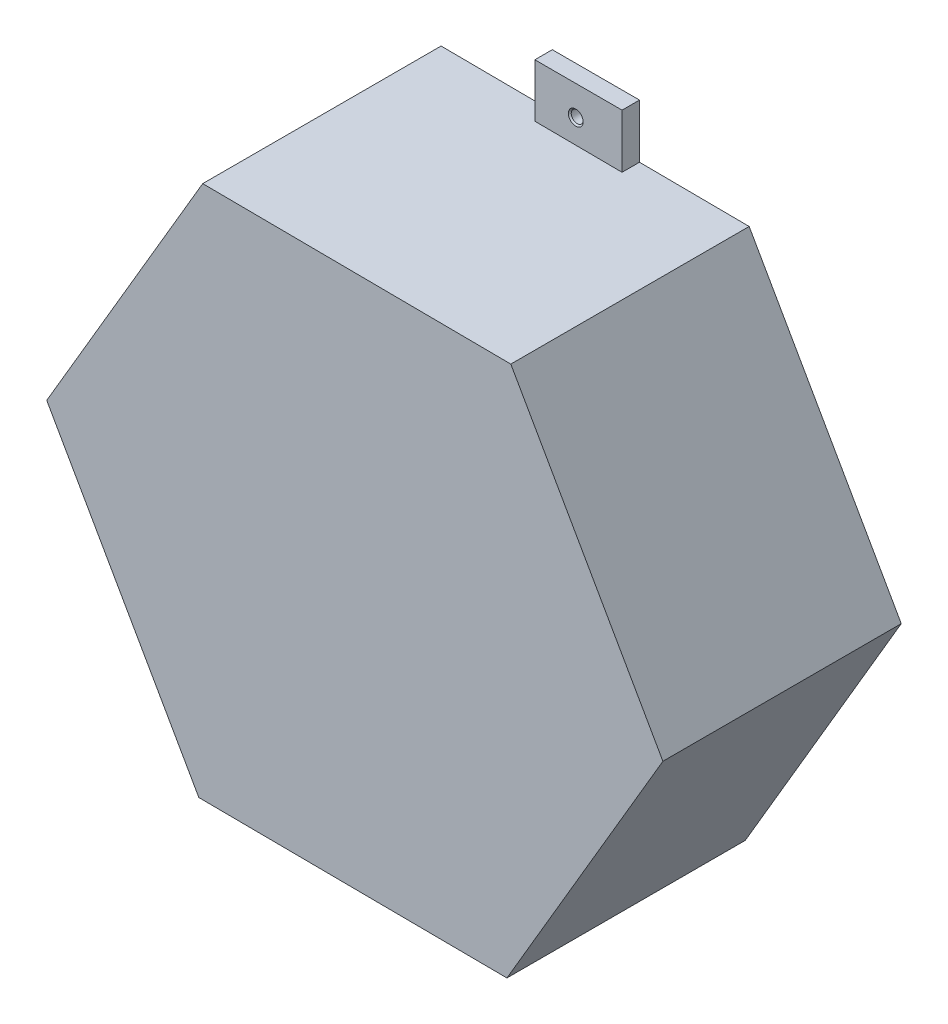
ISO-10303-21;
HEADER;
FILE_DESCRIPTION(('STEP AP214'),'2;1');
FILE_NAME('part.step','',(''),(''),'','','');
FILE_SCHEMA(('AUTOMOTIVE_DESIGN { 1 0 10303 214 1 1 1 1 }'));
ENDSEC;
DATA;
#1=APPLICATION_CONTEXT('core data for automotive mechanical design processes');
#2=APPLICATION_PROTOCOL_DEFINITION('international standard','automotive_design',2000,#1);
#3=PRODUCT_CONTEXT('',#1,'mechanical');
#4=PRODUCT('Part','Part','',(#3));
#5=PRODUCT_RELATED_PRODUCT_CATEGORY('part','',(#4));
#6=PRODUCT_DEFINITION_FORMATION('','',#4);
#7=PRODUCT_DEFINITION_CONTEXT('part definition',#1,'design');
#8=PRODUCT_DEFINITION('design','',#6,#7);
#9=PRODUCT_DEFINITION_SHAPE('','',#8);
#10=(LENGTH_UNIT() NAMED_UNIT(*) SI_UNIT(.MILLI.,.METRE.));
#11=(NAMED_UNIT(*) PLANE_ANGLE_UNIT() SI_UNIT($,.RADIAN.));
#12=(NAMED_UNIT(*) SI_UNIT($,.STERADIAN.) SOLID_ANGLE_UNIT());
#13=UNCERTAINTY_MEASURE_WITH_UNIT(LENGTH_MEASURE(1.E-05),#10,'distance_accuracy_value','');
#14=(GEOMETRIC_REPRESENTATION_CONTEXT(3) GLOBAL_UNCERTAINTY_ASSIGNED_CONTEXT((#13)) GLOBAL_UNIT_ASSIGNED_CONTEXT((#10,
#11,#12)) REPRESENTATION_CONTEXT('',''));
#15=CARTESIAN_POINT('',(0.,0.,0.));
#16=DIRECTION('',(0.,0.,1.));
#17=DIRECTION('',(1.,0.,0.));
#18=AXIS2_PLACEMENT_3D('',#15,#16,#17);
#19=CARTESIAN_POINT('',(0.,0.,-1.));
#20=DIRECTION('',(0.,0.,1.));
#21=DIRECTION('',(1.,0.,0.));
#22=AXIS2_PLACEMENT_3D('',#19,#20,#21);
#23=PLANE('',#22);
#24=CARTESIAN_POINT('',(0.,0.,-1.));
#25=DIRECTION('',(0.,0.,-1.));
#26=DIRECTION('',(-1.,0.,0.));
#27=AXIS2_PLACEMENT_3D('',#24,#25,#26);
#28=CIRCLE('',#27,44.);
#29=CARTESIAN_POINT('',(-44.,0.,-1.));
#30=VERTEX_POINT('',#29);
#31=EDGE_CURVE('E284',#30,#30,#28,.T.);
#32=ORIENTED_EDGE('',*,*,#31,.F.);
#33=EDGE_LOOP('',(#32));
#34=FACE_BOUND('',#33,.T.);
#35=CARTESIAN_POINT('',(0.,-50.,-1.));
#36=DIRECTION('',(0.,0.,1.));
#37=DIRECTION('',(1.,0.,0.));
#38=AXIS2_PLACEMENT_3D('',#35,#36,#37);
#39=CIRCLE('',#38,1.025);
#40=CARTESIAN_POINT('',(1.025,-50.,-1.));
#41=VERTEX_POINT('',#40);
#42=EDGE_CURVE('E148',#41,#41,#39,.T.);
#43=ORIENTED_EDGE('',*,*,#42,.T.);
#44=EDGE_LOOP('',(#43));
#45=FACE_BOUND('',#44,.T.);
#46=DIRECTION('',(0.,1.,0.));
#47=VECTOR('',#46,1.);
#48=CARTESIAN_POINT('',(-7.03198820060748,-45.1010925654476,-1.));
#49=LINE('',#48,#47);
#50=CARTESIAN_POINT('',(-7.03198820060748,-55.1010925654476,-1.));
#51=VERTEX_POINT('',#50);
#52=CARTESIAN_POINT('',(-7.03198820060748,-45.8450767337576,-1.00000000000002));
#53=VERTEX_POINT('',#52);
#54=EDGE_CURVE('E111',#51,#53,#49,.T.);
#55=ORIENTED_EDGE('',*,*,#54,.T.);
#56=DIRECTION('',(0.999973517702037,-0.00727762973876748,0.));
#57=VECTOR('',#56,1.);
#58=CARTESIAN_POINT('',(-26.8308184233019,-45.700984362239,-1.00000000000002));
#59=LINE('',#58,#57);
#60=CARTESIAN_POINT('',(-26.8308184233019,-45.700984362239,-1.00000000000002));
#61=VERTEX_POINT('',#60);
#62=EDGE_CURVE('E273',#61,#53,#59,.T.);
#63=ORIENTED_EDGE('',*,*,#62,.F.);
#64=DIRECTION('',(0.493684146617909,-0.869641284311035,0.));
#65=VECTOR('',#64,1.);
#66=CARTESIAN_POINT('',(-52.9936226473053,0.385678177787459,-1.00000000000002));
#67=LINE('',#66,#65);
#68=CARTESIAN_POINT('',(-52.9936226473053,0.385678177787459,-1.00000000000002));
#69=VERTEX_POINT('',#68);
#70=EDGE_CURVE('E277',#69,#61,#67,.T.);
#71=ORIENTED_EDGE('',*,*,#70,.F.);
#72=DIRECTION('',(-0.506289371084128,-0.862363654572268,0.));
#73=VECTOR('',#72,1.);
#74=CARTESIAN_POINT('',(-26.1628042240034,46.0866625400264,-1.00000000000002));
#75=LINE('',#74,#73);
#76=CARTESIAN_POINT('',(-26.1628042240034,46.0866625400264,-1.00000000000002));
#77=VERTEX_POINT('',#76);
#78=EDGE_CURVE('E239',#77,#69,#75,.T.);
#79=ORIENTED_EDGE('',*,*,#78,.F.);
#80=DIRECTION('',(-0.999973517702037,0.00727762973876722,0.));
#81=VECTOR('',#80,1.);
#82=CARTESIAN_POINT('',(26.8308184233019,45.700984362239,-1.00000000000002));
#83=LINE('',#82,#81);
#84=CARTESIAN_POINT('',(-7.03198820060748,45.9474318572593,-1.00000000000002));
#85=VERTEX_POINT('',#84);
#86=EDGE_CURVE('E264',#85,#77,#83,.T.);
#87=ORIENTED_EDGE('',*,*,#86,.F.);
#88=DIRECTION('',(0.,1.,0.));
#89=VECTOR('',#88,1.);
#90=CARTESIAN_POINT('',(-7.03198820060748,45.1010925654474,-1.));
#91=LINE('',#90,#89);
#92=CARTESIAN_POINT('',(-7.03198820060748,55.1010925654474,-1.));
#93=VERTEX_POINT('',#92);
#94=EDGE_CURVE('E160',#85,#93,#91,.T.);
#95=ORIENTED_EDGE('',*,*,#94,.T.);
#96=DIRECTION('',(1.,0.,0.));
#97=VECTOR('',#96,1.);
#98=CARTESIAN_POINT('',(7.96801179939252,55.1010925654474,-1.));
#99=LINE('',#98,#97);
#100=CARTESIAN_POINT('',(7.96801179939252,55.1010925654474,-1.));
#101=VERTEX_POINT('',#100);
#102=EDGE_CURVE('E143',#93,#101,#99,.T.);
#103=ORIENTED_EDGE('',*,*,#102,.T.);
#104=DIRECTION('',(0.,-1.,0.));
#105=VECTOR('',#104,1.);
#106=CARTESIAN_POINT('',(7.96801179939252,45.1010925654474,-1.));
#107=LINE('',#106,#105);
#108=CARTESIAN_POINT('',(7.96801179939252,45.8382645201758,-1.00000000000002));
#109=VERTEX_POINT('',#108);
#110=EDGE_CURVE('E155',#101,#109,#107,.T.);
#111=ORIENTED_EDGE('',*,*,#110,.T.);
#112=CARTESIAN_POINT('',(26.8308184233019,45.700984362239,-1.00000000000002));
#113=VERTEX_POINT('',#112);
#114=EDGE_CURVE('E216',#113,#109,#83,.T.);
#115=ORIENTED_EDGE('',*,*,#114,.F.);
#116=DIRECTION('',(-0.493684146617909,0.869641284311036,0.));
#117=VECTOR('',#116,1.);
#118=CARTESIAN_POINT('',(52.9936226473053,-0.385678177787459,-1.00000000000002));
#119=LINE('',#118,#117);
#120=CARTESIAN_POINT('',(52.9936226473053,-0.385678177787459,-1.00000000000002));
#121=VERTEX_POINT('',#120);
#122=EDGE_CURVE('E265',#121,#113,#119,.T.);
#123=ORIENTED_EDGE('',*,*,#122,.F.);
#124=DIRECTION('',(0.506289371084128,0.862363654572268,0.));
#125=VECTOR('',#124,1.);
#126=CARTESIAN_POINT('',(26.1628042240034,-46.0866625400264,-1.00000000000002));
#127=LINE('',#126,#125);
#128=CARTESIAN_POINT('',(26.1628042240034,-46.0866625400264,-1.00000000000002));
#129=VERTEX_POINT('',#128);
#130=EDGE_CURVE('E269',#129,#121,#127,.T.);
#131=ORIENTED_EDGE('',*,*,#130,.F.);
#132=CARTESIAN_POINT('',(7.96801179939252,-45.954244070841,-1.00000000000002));
#133=VERTEX_POINT('',#132);
#134=EDGE_CURVE('E276',#133,#129,#59,.T.);
#135=ORIENTED_EDGE('',*,*,#134,.F.);
#136=DIRECTION('',(0.,-1.,0.));
#137=VECTOR('',#136,1.);
#138=CARTESIAN_POINT('',(7.96801179939252,-45.1010925654473,-1.));
#139=LINE('',#138,#137);
#140=CARTESIAN_POINT('',(7.96801179939252,-55.1010925654476,-1.));
#141=VERTEX_POINT('',#140);
#142=EDGE_CURVE('E153',#133,#141,#139,.T.);
#143=ORIENTED_EDGE('',*,*,#142,.T.);
#144=DIRECTION('',(-1.,0.,0.));
#145=VECTOR('',#144,1.);
#146=CARTESIAN_POINT('',(7.96801179939252,-55.1010925654476,-1.));
#147=LINE('',#146,#145);
#148=EDGE_CURVE('E118',#141,#51,#147,.T.);
#149=ORIENTED_EDGE('',*,*,#148,.T.);
#150=EDGE_LOOP('',(#55,#63,#71,#79,#87,#95,#103,#111,#115,#123,#131,#135,#143,#149));
#151=FACE_BOUND('',#150,.T.);
#152=CARTESIAN_POINT('',(0.,50.,-1.));
#153=DIRECTION('',(0.,0.,1.));
#154=DIRECTION('',(1.,0.,0.));
#155=AXIS2_PLACEMENT_3D('',#152,#153,#154);
#156=CIRCLE('',#155,1.025);
#157=CARTESIAN_POINT('',(1.025,50.,-1.));
#158=VERTEX_POINT('',#157);
#159=EDGE_CURVE('E186',#158,#158,#156,.T.);
#160=ORIENTED_EDGE('',*,*,#159,.T.);
#161=EDGE_LOOP('',(#160));
#162=FACE_BOUND('',#161,.T.);
#163=ADVANCED_FACE('F49',(#34,#45,#151,#162),#23,.F.);
#164=CARTESIAN_POINT('',(7.96801179939252,45.1010925654474,1.99999999999999));
#165=DIRECTION('',(1.,0.,0.));
#166=DIRECTION('',(0.,0.,-1.));
#167=AXIS2_PLACEMENT_3D('',#164,#165,#166);
#168=PLANE('',#167);
#169=DIRECTION('',(0.,0.,1.));
#170=VECTOR('',#169,1.);
#171=CARTESIAN_POINT('',(7.96801179939252,45.8382645201758,1.99999999999999));
#172=LINE('',#171,#170);
#173=CARTESIAN_POINT('',(7.96801179939252,45.8382645201758,1.99999999999999));
#174=VERTEX_POINT('',#173);
#175=EDGE_CURVE('E198',#109,#174,#172,.T.);
#176=ORIENTED_EDGE('',*,*,#175,.F.);
#177=ORIENTED_EDGE('',*,*,#110,.F.);
#178=DIRECTION('',(0.,0.,-1.));
#179=VECTOR('',#178,1.);
#180=CARTESIAN_POINT('',(7.96801179939252,55.1010925654474,1.99999999999999));
#181=LINE('',#180,#179);
#182=CARTESIAN_POINT('',(7.96801179939252,55.1010925654474,1.99999999999999));
#183=VERTEX_POINT('',#182);
#184=EDGE_CURVE('E73',#183,#101,#181,.T.);
#185=ORIENTED_EDGE('',*,*,#184,.F.);
#186=DIRECTION('',(0.,-1.,0.));
#187=VECTOR('',#186,1.);
#188=CARTESIAN_POINT('',(7.96801179939252,45.1010925654474,1.99999999999999));
#189=LINE('',#188,#187);
#190=EDGE_CURVE('E172',#183,#174,#189,.T.);
#191=ORIENTED_EDGE('',*,*,#190,.T.);
#192=EDGE_LOOP('',(#176,#177,#185,#191));
#193=FACE_BOUND('',#192,.T.);
#194=ADVANCED_FACE('F303',(#193),#168,.T.);
#195=CARTESIAN_POINT('',(7.96801179939252,55.1010925654474,1.99999999999999));
#196=DIRECTION('',(0.,1.,0.));
#197=DIRECTION('',(0.,0.,1.));
#198=AXIS2_PLACEMENT_3D('',#195,#196,#197);
#199=PLANE('',#198);
#200=ORIENTED_EDGE('',*,*,#102,.F.);
#201=DIRECTION('',(0.,0.,-1.));
#202=VECTOR('',#201,1.);
#203=CARTESIAN_POINT('',(-7.03198820060748,55.1010925654474,1.99999999999999));
#204=LINE('',#203,#202);
#205=CARTESIAN_POINT('',(-7.03198820060748,55.1010925654474,1.99999999999999));
#206=VERTEX_POINT('',#205);
#207=EDGE_CURVE('E133',#206,#93,#204,.T.);
#208=ORIENTED_EDGE('',*,*,#207,.F.);
#209=DIRECTION('',(1.,0.,0.));
#210=VECTOR('',#209,1.);
#211=CARTESIAN_POINT('',(7.96801179939252,55.1010925654474,1.99999999999999));
#212=LINE('',#211,#210);
#213=EDGE_CURVE('E140',#206,#183,#212,.T.);
#214=ORIENTED_EDGE('',*,*,#213,.T.);
#215=ORIENTED_EDGE('',*,*,#184,.T.);
#216=EDGE_LOOP('',(#200,#208,#214,#215));
#217=FACE_BOUND('',#216,.T.);
#218=ADVANCED_FACE('F336',(#217),#199,.T.);
#219=CARTESIAN_POINT('',(-7.03198820060748,45.1010925654474,1.99999999999999));
#220=DIRECTION('',(-1.,0.,0.));
#221=DIRECTION('',(0.,0.,1.));
#222=AXIS2_PLACEMENT_3D('',#219,#220,#221);
#223=PLANE('',#222);
#224=DIRECTION('',(0.,0.,-1.));
#225=VECTOR('',#224,1.);
#226=CARTESIAN_POINT('',(-7.03198820060748,45.9474318572593,1.99999999999999));
#227=LINE('',#226,#225);
#228=CARTESIAN_POINT('',(-7.03198820060748,45.9474318572593,1.99999999999999));
#229=VERTEX_POINT('',#228);
#230=EDGE_CURVE('E202',#229,#85,#227,.T.);
#231=ORIENTED_EDGE('',*,*,#230,.F.);
#232=DIRECTION('',(0.,1.,0.));
#233=VECTOR('',#232,1.);
#234=CARTESIAN_POINT('',(-7.03198820060748,45.1010925654474,1.99999999999999));
#235=LINE('',#234,#233);
#236=EDGE_CURVE('E169',#229,#206,#235,.T.);
#237=ORIENTED_EDGE('',*,*,#236,.T.);
#238=ORIENTED_EDGE('',*,*,#207,.T.);
#239=ORIENTED_EDGE('',*,*,#94,.F.);
#240=EDGE_LOOP('',(#231,#237,#238,#239));
#241=FACE_BOUND('',#240,.T.);
#242=ADVANCED_FACE('F327',(#241),#223,.T.);
#243=CARTESIAN_POINT('',(0.,0.,1.99999999999999));
#244=DIRECTION('',(0.,0.,1.));
#245=DIRECTION('',(1.,0.,0.));
#246=AXIS2_PLACEMENT_3D('',#243,#244,#245);
#247=PLANE('',#246);
#248=DIRECTION('',(-0.999973517702037,0.00727762973876722,0.));
#249=VECTOR('',#248,1.);
#250=CARTESIAN_POINT('',(0.334007099649231,45.8938234511327,1.99999999999999));
#251=LINE('',#250,#249);
#252=EDGE_CURVE('E11',#174,#229,#251,.T.);
#253=ORIENTED_EDGE('',*,*,#252,.F.);
#254=ORIENTED_EDGE('',*,*,#190,.F.);
#255=ORIENTED_EDGE('',*,*,#213,.F.);
#256=ORIENTED_EDGE('',*,*,#236,.F.);
#257=EDGE_LOOP('',(#253,#254,#255,#256));
#258=FACE_BOUND('',#257,.T.);
#259=CARTESIAN_POINT('',(0.,50.,1.99999999999999));
#260=DIRECTION('',(0.,0.,1.));
#261=DIRECTION('',(1.,0.,0.));
#262=AXIS2_PLACEMENT_3D('',#259,#260,#261);
#263=CIRCLE('',#262,1.275);
#264=CARTESIAN_POINT('',(1.275,50.,1.99999999999999));
#265=VERTEX_POINT('',#264);
#266=EDGE_CURVE('E194',#265,#265,#263,.T.);
#267=ORIENTED_EDGE('',*,*,#266,.F.);
#268=EDGE_LOOP('',(#267));
#269=FACE_BOUND('',#268,.T.);
#270=ADVANCED_FACE('F325',(#258,#269),#247,.T.);
#271=CARTESIAN_POINT('',(7.96801179939252,-45.1010925654473,1.99999999999999));
#272=DIRECTION('',(1.,0.,0.));
#273=DIRECTION('',(0.,1.,0.));
#274=AXIS2_PLACEMENT_3D('',#271,#272,#273);
#275=PLANE('',#274);
#276=DIRECTION('',(0.,0.,-1.));
#277=VECTOR('',#276,1.);
#278=CARTESIAN_POINT('',(7.96801179939252,-45.954244070841,1.99999999999999));
#279=LINE('',#278,#277);
#280=CARTESIAN_POINT('',(7.96801179939252,-45.954244070841,1.99999999999999));
#281=VERTEX_POINT('',#280);
#282=EDGE_CURVE('E107',#281,#133,#279,.T.);
#283=ORIENTED_EDGE('',*,*,#282,.F.);
#284=DIRECTION('',(0.,-1.,0.));
#285=VECTOR('',#284,1.);
#286=CARTESIAN_POINT('',(7.96801179939252,-45.1010925654473,1.99999999999999));
#287=LINE('',#286,#285);
#288=CARTESIAN_POINT('',(7.96801179939252,-55.1010925654476,1.99999999999999));
#289=VERTEX_POINT('',#288);
#290=EDGE_CURVE('E99',#281,#289,#287,.T.);
#291=ORIENTED_EDGE('',*,*,#290,.T.);
#292=DIRECTION('',(0.,0.,-1.));
#293=VECTOR('',#292,1.);
#294=CARTESIAN_POINT('',(7.96801179939252,-55.1010925654476,1.99999999999999));
#295=LINE('',#294,#293);
#296=EDGE_CURVE('E103',#289,#141,#295,.T.);
#297=ORIENTED_EDGE('',*,*,#296,.T.);
#298=ORIENTED_EDGE('',*,*,#142,.F.);
#299=EDGE_LOOP('',(#283,#291,#297,#298));
#300=FACE_BOUND('',#299,.T.);
#301=ADVANCED_FACE('F101',(#300),#275,.T.);
#302=CARTESIAN_POINT('',(-7.03198820060748,-45.1010925654476,1.99999999999999));
#303=DIRECTION('',(-1.,0.,0.));
#304=DIRECTION('',(0.,0.,1.));
#305=AXIS2_PLACEMENT_3D('',#302,#303,#304);
#306=PLANE('',#305);
#307=DIRECTION('',(0.,0.,1.));
#308=VECTOR('',#307,1.);
#309=CARTESIAN_POINT('',(-7.03198820060748,-45.8450767337576,1.99999999999999));
#310=LINE('',#309,#308);
#311=CARTESIAN_POINT('',(-7.03198820060748,-45.8450767337576,1.99999999999999));
#312=VERTEX_POINT('',#311);
#313=EDGE_CURVE('E64',#53,#312,#310,.T.);
#314=ORIENTED_EDGE('',*,*,#313,.F.);
#315=ORIENTED_EDGE('',*,*,#54,.F.);
#316=DIRECTION('',(0.,0.,-1.));
#317=VECTOR('',#316,1.);
#318=CARTESIAN_POINT('',(-7.03198820060748,-55.1010925654476,1.99999999999999));
#319=LINE('',#318,#317);
#320=CARTESIAN_POINT('',(-7.03198820060748,-55.1010925654476,1.99999999999999));
#321=VERTEX_POINT('',#320);
#322=EDGE_CURVE('E121',#321,#51,#319,.T.);
#323=ORIENTED_EDGE('',*,*,#322,.F.);
#324=DIRECTION('',(0.,1.,0.));
#325=VECTOR('',#324,1.);
#326=CARTESIAN_POINT('',(-7.03198820060748,-45.1010925654476,1.99999999999999));
#327=LINE('',#326,#325);
#328=EDGE_CURVE('E120',#321,#312,#327,.T.);
#329=ORIENTED_EDGE('',*,*,#328,.T.);
#330=EDGE_LOOP('',(#314,#315,#323,#329));
#331=FACE_BOUND('',#330,.T.);
#332=ADVANCED_FACE('F334',(#331),#306,.T.);
#333=CARTESIAN_POINT('',(7.96801179939252,-55.1010925654476,1.99999999999999));
#334=DIRECTION('',(0.,-1.,0.));
#335=DIRECTION('',(0.,0.,-1.));
#336=AXIS2_PLACEMENT_3D('',#333,#334,#335);
#337=PLANE('',#336);
#338=ORIENTED_EDGE('',*,*,#148,.F.);
#339=ORIENTED_EDGE('',*,*,#296,.F.);
#340=DIRECTION('',(-1.,0.,0.));
#341=VECTOR('',#340,1.);
#342=CARTESIAN_POINT('',(7.96801179939252,-55.1010925654476,1.99999999999999));
#343=LINE('',#342,#341);
#344=EDGE_CURVE('E112',#289,#321,#343,.T.);
#345=ORIENTED_EDGE('',*,*,#344,.T.);
#346=ORIENTED_EDGE('',*,*,#322,.T.);
#347=EDGE_LOOP('',(#338,#339,#345,#346));
#348=FACE_BOUND('',#347,.T.);
#349=ADVANCED_FACE('F116',(#348),#337,.T.);
#350=CARTESIAN_POINT('',(0.,0.,1.99999999999999));
#351=DIRECTION('',(0.,0.,-1.));
#352=DIRECTION('',(-1.,0.,0.));
#353=AXIS2_PLACEMENT_3D('',#350,#351,#352);
#354=PLANE('',#353);
#355=CARTESIAN_POINT('',(0.,-50.,1.99999999999999));
#356=DIRECTION('',(0.,0.,1.));
#357=DIRECTION('',(1.,0.,0.));
#358=AXIS2_PLACEMENT_3D('',#355,#356,#357);
#359=CIRCLE('',#358,1.275);
#360=CARTESIAN_POINT('',(1.275,-50.,1.99999999999999));
#361=VERTEX_POINT('',#360);
#362=EDGE_CURVE('E182',#361,#361,#359,.T.);
#363=ORIENTED_EDGE('',*,*,#362,.F.);
#364=EDGE_LOOP('',(#363));
#365=FACE_BOUND('',#364,.T.);
#366=ORIENTED_EDGE('',*,*,#290,.F.);
#367=DIRECTION('',(-0.999973517702037,0.00727762973876748,0.));
#368=VECTOR('',#367,1.);
#369=CARTESIAN_POINT('',(-0.334007099649243,-45.8938234511327,1.99999999999999));
#370=LINE('',#369,#368);
#371=EDGE_CURVE('E57',#281,#312,#370,.T.);
#372=ORIENTED_EDGE('',*,*,#371,.T.);
#373=ORIENTED_EDGE('',*,*,#328,.F.);
#374=ORIENTED_EDGE('',*,*,#344,.F.);
#375=EDGE_LOOP('',(#366,#372,#373,#374));
#376=FACE_BOUND('',#375,.T.);
#377=ADVANCED_FACE('F124',(#365,#376),#354,.F.);
#378=CARTESIAN_POINT('',(0.,-50.,1.99999999999999));
#379=DIRECTION('',(0.,0.,1.));
#380=DIRECTION('',(1.,0.,0.));
#381=AXIS2_PLACEMENT_3D('',#378,#379,#380);
#382=CYLINDRICAL_SURFACE('',#381,1.025);
#383=ORIENTED_EDGE('',*,*,#42,.F.);
#384=EDGE_LOOP('',(#383));
#385=FACE_BOUND('',#384,.T.);
#386=CARTESIAN_POINT('',(0.,-50.,1.74999999999999));
#387=DIRECTION('',(0.,0.,1.));
#388=DIRECTION('',(1.,0.,0.));
#389=AXIS2_PLACEMENT_3D('',#386,#387,#388);
#390=CIRCLE('',#389,1.025);
#391=CARTESIAN_POINT('',(1.025,-50.,1.74999999999999));
#392=VERTEX_POINT('',#391);
#393=EDGE_CURVE('E178',#392,#392,#390,.T.);
#394=ORIENTED_EDGE('',*,*,#393,.T.);
#395=EDGE_LOOP('',(#394));
#396=FACE_BOUND('',#395,.T.);
#397=ADVANCED_FACE('F342',(#385,#396),#382,.F.);
#398=CARTESIAN_POINT('',(0.,-50.,1.99999999999999));
#399=DIRECTION('',(0.,0.,1.));
#400=DIRECTION('',(1.,0.,0.));
#401=AXIS2_PLACEMENT_3D('',#398,#399,#400);
#402=CONICAL_SURFACE('',#401,1.275,0.785398163397451);
#403=ORIENTED_EDGE('',*,*,#393,.F.);
#404=EDGE_LOOP('',(#403));
#405=FACE_BOUND('',#404,.T.);
#406=ORIENTED_EDGE('',*,*,#362,.T.);
#407=EDGE_LOOP('',(#406));
#408=FACE_BOUND('',#407,.T.);
#409=ADVANCED_FACE('F315',(#405,#408),#402,.F.);
#410=CARTESIAN_POINT('',(0.,50.,1.99999999999999));
#411=DIRECTION('',(0.,0.,1.));
#412=DIRECTION('',(1.,0.,0.));
#413=AXIS2_PLACEMENT_3D('',#410,#411,#412);
#414=CYLINDRICAL_SURFACE('',#413,1.025);
#415=ORIENTED_EDGE('',*,*,#159,.F.);
#416=EDGE_LOOP('',(#415));
#417=FACE_BOUND('',#416,.T.);
#418=CARTESIAN_POINT('',(0.,50.,1.74999999999999));
#419=DIRECTION('',(0.,0.,1.));
#420=DIRECTION('',(1.,0.,0.));
#421=AXIS2_PLACEMENT_3D('',#418,#419,#420);
#422=CIRCLE('',#421,1.025);
#423=CARTESIAN_POINT('',(1.025,50.,1.74999999999999));
#424=VERTEX_POINT('',#423);
#425=EDGE_CURVE('E190',#424,#424,#422,.T.);
#426=ORIENTED_EDGE('',*,*,#425,.T.);
#427=EDGE_LOOP('',(#426));
#428=FACE_BOUND('',#427,.T.);
#429=ADVANCED_FACE('F311',(#417,#428),#414,.F.);
#430=CARTESIAN_POINT('',(0.,50.,1.99999999999999));
#431=DIRECTION('',(0.,0.,1.));
#432=DIRECTION('',(1.,0.,0.));
#433=AXIS2_PLACEMENT_3D('',#430,#431,#432);
#434=CONICAL_SURFACE('',#433,1.275,0.785398163397451);
#435=ORIENTED_EDGE('',*,*,#425,.F.);
#436=EDGE_LOOP('',(#435));
#437=FACE_BOUND('',#436,.T.);
#438=ORIENTED_EDGE('',*,*,#266,.T.);
#439=EDGE_LOOP('',(#438));
#440=FACE_BOUND('',#439,.T.);
#441=ADVANCED_FACE('F314',(#437,#440),#434,.F.);
#442=CARTESIAN_POINT('',(-52.9936226473053,0.385678177787459,-1.00000000000002));
#443=DIRECTION('',(-0.869641284311035,-0.493684146617909,0.));
#444=DIRECTION('',(0.493684146617909,-0.869641284311036,0.));
#445=AXIS2_PLACEMENT_3D('',#442,#443,#444);
#446=PLANE('',#445);
#447=DIRECTION('',(0.493684146617909,-0.869641284311035,0.));
#448=VECTOR('',#447,1.);
#449=CARTESIAN_POINT('',(-52.9936226473053,0.385678177787459,40.));
#450=LINE('',#449,#448);
#451=CARTESIAN_POINT('',(-52.9936226473053,0.385678177787459,40.));
#452=VERTEX_POINT('',#451);
#453=CARTESIAN_POINT('',(-26.8308184233019,-45.700984362239,40.));
#454=VERTEX_POINT('',#453);
#455=EDGE_CURVE('E252',#452,#454,#450,.T.);
#456=ORIENTED_EDGE('',*,*,#455,.F.);
#457=DIRECTION('',(0.,0.,1.));
#458=VECTOR('',#457,1.);
#459=CARTESIAN_POINT('',(-52.9936226473053,0.385678177787459,-1.00000000000002));
#460=LINE('',#459,#458);
#461=EDGE_CURVE('E211',#69,#452,#460,.T.);
#462=ORIENTED_EDGE('',*,*,#461,.F.);
#463=ORIENTED_EDGE('',*,*,#70,.T.);
#464=DIRECTION('',(0.,0.,1.));
#465=VECTOR('',#464,1.);
#466=CARTESIAN_POINT('',(-26.8308184233019,-45.700984362239,-1.00000000000002));
#467=LINE('',#466,#465);
#468=EDGE_CURVE('E215',#61,#454,#467,.T.);
#469=ORIENTED_EDGE('',*,*,#468,.T.);
#470=EDGE_LOOP('',(#456,#462,#463,#469));
#471=FACE_BOUND('',#470,.T.);
#472=ADVANCED_FACE('F321',(#471),#446,.T.);
#473=CARTESIAN_POINT('',(-26.8308184233019,-45.700984362239,-1.00000000000002));
#474=DIRECTION('',(-0.00727762973876748,-0.999973517702037,0.));
#475=DIRECTION('',(0.999973517702037,-0.00727762973876748,0.));
#476=AXIS2_PLACEMENT_3D('',#473,#474,#475);
#477=PLANE('',#476);
#478=ORIENTED_EDGE('',*,*,#371,.F.);
#479=ORIENTED_EDGE('',*,*,#282,.T.);
#480=ORIENTED_EDGE('',*,*,#134,.T.);
#481=DIRECTION('',(0.,0.,1.));
#482=VECTOR('',#481,1.);
#483=CARTESIAN_POINT('',(26.1628042240034,-46.0866625400264,-1.00000000000002));
#484=LINE('',#483,#482);
#485=CARTESIAN_POINT('',(26.1628042240034,-46.0866625400264,40.));
#486=VERTEX_POINT('',#485);
#487=EDGE_CURVE('E220',#129,#486,#484,.T.);
#488=ORIENTED_EDGE('',*,*,#487,.T.);
#489=DIRECTION('',(0.999973517702037,-0.00727762973876748,0.));
#490=VECTOR('',#489,1.);
#491=CARTESIAN_POINT('',(-26.8308184233019,-45.700984362239,40.));
#492=LINE('',#491,#490);
#493=EDGE_CURVE('E248',#454,#486,#492,.T.);
#494=ORIENTED_EDGE('',*,*,#493,.F.);
#495=ORIENTED_EDGE('',*,*,#468,.F.);
#496=ORIENTED_EDGE('',*,*,#62,.T.);
#497=ORIENTED_EDGE('',*,*,#313,.T.);
#498=EDGE_LOOP('',(#478,#479,#480,#488,#494,#495,#496,#497));
#499=FACE_BOUND('',#498,.T.);
#500=ADVANCED_FACE('F408',(#499),#477,.T.);
#501=CARTESIAN_POINT('',(26.1628042240034,-46.0866625400264,-1.00000000000002));
#502=DIRECTION('',(0.862363654572268,-0.506289371084128,0.));
#503=DIRECTION('',(0.506289371084128,0.862363654572268,0.));
#504=AXIS2_PLACEMENT_3D('',#501,#502,#503);
#505=PLANE('',#504);
#506=DIRECTION('',(0.506289371084128,0.862363654572268,0.));
#507=VECTOR('',#506,1.);
#508=CARTESIAN_POINT('',(26.1628042240034,-46.0866625400264,40.));
#509=LINE('',#508,#507);
#510=CARTESIAN_POINT('',(52.9936226473053,-0.385678177787459,40.));
#511=VERTEX_POINT('',#510);
#512=EDGE_CURVE('E244',#486,#511,#509,.T.);
#513=ORIENTED_EDGE('',*,*,#512,.F.);
#514=ORIENTED_EDGE('',*,*,#487,.F.);
#515=ORIENTED_EDGE('',*,*,#130,.T.);
#516=DIRECTION('',(0.,0.,1.));
#517=VECTOR('',#516,1.);
#518=CARTESIAN_POINT('',(52.9936226473053,-0.385678177787459,-1.00000000000002));
#519=LINE('',#518,#517);
#520=EDGE_CURVE('E224',#121,#511,#519,.T.);
#521=ORIENTED_EDGE('',*,*,#520,.T.);
#522=EDGE_LOOP('',(#513,#514,#515,#521));
#523=FACE_BOUND('',#522,.T.);
#524=ADVANCED_FACE('F416',(#523),#505,.T.);
#525=CARTESIAN_POINT('',(52.9936226473053,-0.385678177787459,-1.00000000000002));
#526=DIRECTION('',(0.869641284311035,0.493684146617909,0.));
#527=DIRECTION('',(-0.493684146617909,0.869641284311036,0.));
#528=AXIS2_PLACEMENT_3D('',#525,#526,#527);
#529=PLANE('',#528);
#530=DIRECTION('',(-0.493684146617909,0.869641284311036,0.));
#531=VECTOR('',#530,1.);
#532=CARTESIAN_POINT('',(52.9936226473053,-0.385678177787459,40.));
#533=LINE('',#532,#531);
#534=CARTESIAN_POINT('',(26.8308184233019,45.700984362239,40.));
#535=VERTEX_POINT('',#534);
#536=EDGE_CURVE('E240',#511,#535,#533,.T.);
#537=ORIENTED_EDGE('',*,*,#536,.F.);
#538=ORIENTED_EDGE('',*,*,#520,.F.);
#539=ORIENTED_EDGE('',*,*,#122,.T.);
#540=DIRECTION('',(0.,0.,1.));
#541=VECTOR('',#540,1.);
#542=CARTESIAN_POINT('',(26.8308184233019,45.700984362239,-1.00000000000002));
#543=LINE('',#542,#541);
#544=EDGE_CURVE('E228',#113,#535,#543,.T.);
#545=ORIENTED_EDGE('',*,*,#544,.T.);
#546=EDGE_LOOP('',(#537,#538,#539,#545));
#547=FACE_BOUND('',#546,.T.);
#548=ADVANCED_FACE('F423',(#547),#529,.T.);
#549=CARTESIAN_POINT('',(26.8308184233019,45.700984362239,-1.00000000000002));
#550=DIRECTION('',(0.00727762973876722,0.999973517702037,0.));
#551=DIRECTION('',(-0.999973517702037,0.00727762973876722,0.));
#552=AXIS2_PLACEMENT_3D('',#549,#550,#551);
#553=PLANE('',#552);
#554=ORIENTED_EDGE('',*,*,#114,.T.);
#555=ORIENTED_EDGE('',*,*,#175,.T.);
#556=ORIENTED_EDGE('',*,*,#252,.T.);
#557=ORIENTED_EDGE('',*,*,#230,.T.);
#558=ORIENTED_EDGE('',*,*,#86,.T.);
#559=DIRECTION('',(0.,0.,1.));
#560=VECTOR('',#559,1.);
#561=CARTESIAN_POINT('',(-26.1628042240034,46.0866625400264,-1.00000000000002));
#562=LINE('',#561,#560);
#563=CARTESIAN_POINT('',(-26.1628042240034,46.0866625400264,40.));
#564=VERTEX_POINT('',#563);
#565=EDGE_CURVE('E210',#77,#564,#562,.T.);
#566=ORIENTED_EDGE('',*,*,#565,.T.);
#567=DIRECTION('',(-0.999973517702037,0.00727762973876722,0.));
#568=VECTOR('',#567,1.);
#569=CARTESIAN_POINT('',(26.8308184233019,45.700984362239,40.));
#570=LINE('',#569,#568);
#571=EDGE_CURVE('E235',#535,#564,#570,.T.);
#572=ORIENTED_EDGE('',*,*,#571,.F.);
#573=ORIENTED_EDGE('',*,*,#544,.F.);
#574=EDGE_LOOP('',(#554,#555,#556,#557,#558,#566,#572,#573));
#575=FACE_BOUND('',#574,.T.);
#576=ADVANCED_FACE('F361',(#575),#553,.T.);
#577=CARTESIAN_POINT('',(-26.1628042240034,46.0866625400264,-1.00000000000002));
#578=DIRECTION('',(-0.862363654572268,0.506289371084128,0.));
#579=DIRECTION('',(-0.506289371084128,-0.862363654572268,0.));
#580=AXIS2_PLACEMENT_3D('',#577,#578,#579);
#581=PLANE('',#580);
#582=DIRECTION('',(-0.506289371084128,-0.862363654572268,0.));
#583=VECTOR('',#582,1.);
#584=CARTESIAN_POINT('',(-26.1628042240034,46.0866625400264,40.));
#585=LINE('',#584,#583);
#586=EDGE_CURVE('E256',#564,#452,#585,.T.);
#587=ORIENTED_EDGE('',*,*,#586,.F.);
#588=ORIENTED_EDGE('',*,*,#565,.F.);
#589=ORIENTED_EDGE('',*,*,#78,.T.);
#590=ORIENTED_EDGE('',*,*,#461,.T.);
#591=EDGE_LOOP('',(#587,#588,#589,#590));
#592=FACE_BOUND('',#591,.T.);
#593=ADVANCED_FACE('F356',(#592),#581,.T.);
#594=CARTESIAN_POINT('',(0.,0.,40.));
#595=DIRECTION('',(0.,0.,1.));
#596=DIRECTION('',(1.,0.,0.));
#597=AXIS2_PLACEMENT_3D('',#594,#595,#596);
#598=PLANE('',#597);
#599=ORIENTED_EDGE('',*,*,#586,.T.);
#600=ORIENTED_EDGE('',*,*,#455,.T.);
#601=ORIENTED_EDGE('',*,*,#493,.T.);
#602=ORIENTED_EDGE('',*,*,#512,.T.);
#603=ORIENTED_EDGE('',*,*,#536,.T.);
#604=ORIENTED_EDGE('',*,*,#571,.T.);
#605=EDGE_LOOP('',(#599,#600,#601,#602,#603,#604));
#606=FACE_BOUND('',#605,.T.);
#607=ADVANCED_FACE('F297',(#606),#598,.T.);
#608=CARTESIAN_POINT('',(0.,0.,37.));
#609=DIRECTION('',(0.,0.,-1.));
#610=DIRECTION('',(-1.,0.,0.));
#611=AXIS2_PLACEMENT_3D('',#608,#609,#610);
#612=CYLINDRICAL_SURFACE('',#611,44.);
#613=CARTESIAN_POINT('',(0.,0.,37.));
#614=DIRECTION('',(0.,0.,-1.));
#615=DIRECTION('',(-1.,0.,0.));
#616=AXIS2_PLACEMENT_3D('',#613,#614,#615);
#617=CIRCLE('',#616,44.);
#618=CARTESIAN_POINT('',(-44.,0.,37.));
#619=VERTEX_POINT('',#618);
#620=EDGE_CURVE('E260',#619,#619,#617,.T.);
#621=ORIENTED_EDGE('',*,*,#620,.F.);
#622=EDGE_LOOP('',(#621));
#623=FACE_BOUND('',#622,.T.);
#624=ORIENTED_EDGE('',*,*,#31,.T.);
#625=EDGE_LOOP('',(#624));
#626=FACE_BOUND('',#625,.T.);
#627=ADVANCED_FACE('F294',(#623,#626),#612,.F.);
#628=CARTESIAN_POINT('',(0.,0.,37.));
#629=DIRECTION('',(0.,0.,-1.));
#630=DIRECTION('',(-1.,0.,0.));
#631=AXIS2_PLACEMENT_3D('',#628,#629,#630);
#632=PLANE('',#631);
#633=ORIENTED_EDGE('',*,*,#620,.T.);
#634=EDGE_LOOP('',(#633));
#635=FACE_BOUND('',#634,.T.);
#636=ADVANCED_FACE('F292',(#635),#632,.T.);
#637=CLOSED_SHELL('',(#163,#194,#218,#242,#270,#301,#332,#349,#377,#397,#409,#429,#441,#472,
#500,#524,#548,#576,#593,#607,#627,#636));
#638=MANIFOLD_SOLID_BREP('B2',#637);
#639=ADVANCED_BREP_SHAPE_REPRESENTATION('',(#18,#638),#14);
#640=SHAPE_DEFINITION_REPRESENTATION(#9,#639);
ENDSEC;
END-ISO-10303-21;
